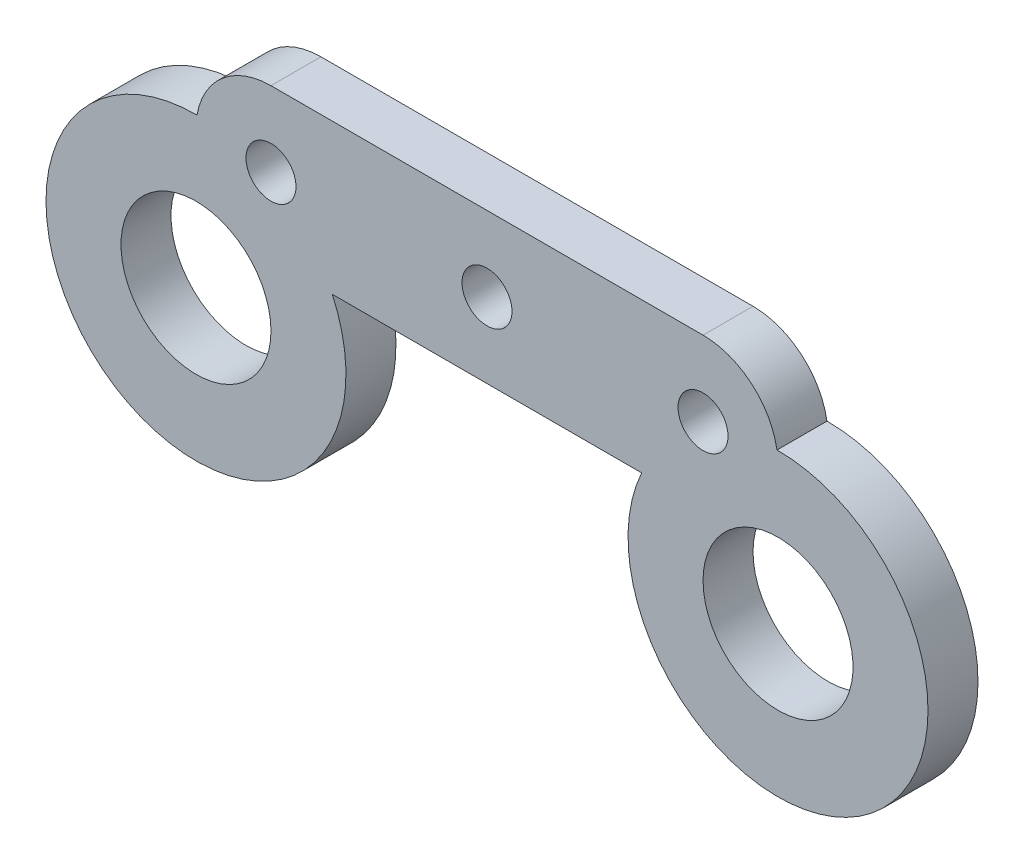
ISO-10303-21;
HEADER;
FILE_DESCRIPTION(('STEP AP214'),'2;1');
FILE_NAME('part.step','',(''),(''),'','','');
FILE_SCHEMA(('AUTOMOTIVE_DESIGN { 1 0 10303 214 1 1 1 1 }'));
ENDSEC;
DATA;
#1=APPLICATION_CONTEXT('core data for automotive mechanical design processes');
#2=APPLICATION_PROTOCOL_DEFINITION('international standard','automotive_design',2000,#1);
#3=PRODUCT_CONTEXT('',#1,'mechanical');
#4=PRODUCT('Part','Part','',(#3));
#5=PRODUCT_RELATED_PRODUCT_CATEGORY('part','',(#4));
#6=PRODUCT_DEFINITION_FORMATION('','',#4);
#7=PRODUCT_DEFINITION_CONTEXT('part definition',#1,'design');
#8=PRODUCT_DEFINITION('design','',#6,#7);
#9=PRODUCT_DEFINITION_SHAPE('','',#8);
#10=(LENGTH_UNIT() NAMED_UNIT(*) SI_UNIT(.MILLI.,.METRE.));
#11=(NAMED_UNIT(*) PLANE_ANGLE_UNIT() SI_UNIT($,.RADIAN.));
#12=(NAMED_UNIT(*) SI_UNIT($,.STERADIAN.) SOLID_ANGLE_UNIT());
#13=UNCERTAINTY_MEASURE_WITH_UNIT(LENGTH_MEASURE(1.E-05),#10,'distance_accuracy_value','');
#14=(GEOMETRIC_REPRESENTATION_CONTEXT(3) GLOBAL_UNCERTAINTY_ASSIGNED_CONTEXT((#13)) GLOBAL_UNIT_ASSIGNED_CONTEXT((#10,
#11,#12)) REPRESENTATION_CONTEXT('',''));
#15=CARTESIAN_POINT('',(0.,0.,0.));
#16=DIRECTION('',(0.,0.,1.));
#17=DIRECTION('',(1.,0.,0.));
#18=AXIS2_PLACEMENT_3D('',#15,#16,#17);
#19=CARTESIAN_POINT('',(-11.6421383013536,-5.50000000000006,2.));
#20=DIRECTION('',(0.,0.,1.));
#21=DIRECTION('',(1.,0.,0.));
#22=AXIS2_PLACEMENT_3D('',#19,#20,#21);
#23=PLANE('',#22);
#24=CARTESIAN_POINT('',(8.64213830135374,0.,2.));
#25=DIRECTION('',(0.,0.,1.));
#26=DIRECTION('',(-1.,0.,0.));
#27=AXIS2_PLACEMENT_3D('',#24,#25,#26);
#28=CIRCLE('',#27,1.00000000000005);
#29=CARTESIAN_POINT('',(7.64213830135369,0.,2.));
#30=VERTEX_POINT('',#29);
#31=EDGE_CURVE('E204',#30,#30,#28,.T.);
#32=ORIENTED_EDGE('',*,*,#31,.F.);
#33=EDGE_LOOP('',(#32));
#34=FACE_BOUND('',#33,.T.);
#35=CARTESIAN_POINT('',(-8.64213830135374,0.,2.));
#36=DIRECTION('',(0.,0.,1.));
#37=DIRECTION('',(1.,0.,0.));
#38=AXIS2_PLACEMENT_3D('',#35,#36,#37);
#39=CIRCLE('',#38,1.00000000000005);
#40=CARTESIAN_POINT('',(-7.64213830135369,0.,2.));
#41=VERTEX_POINT('',#40);
#42=EDGE_CURVE('E216',#41,#41,#39,.T.);
#43=ORIENTED_EDGE('',*,*,#42,.F.);
#44=EDGE_LOOP('',(#43));
#45=FACE_BOUND('',#44,.T.);
#46=CARTESIAN_POINT('',(-11.6421383013536,-5.50000000000006,2.));
#47=DIRECTION('',(0.,0.,1.));
#48=DIRECTION('',(1.,0.,0.));
#49=AXIS2_PLACEMENT_3D('',#46,#47,#48);
#50=CIRCLE('',#49,5.99999999999999);
#51=CARTESIAN_POINT('',(-11.6002029605603,0.499853450476246,2.));
#52=VERTEX_POINT('',#51);
#53=CARTESIAN_POINT('',(-6.18778224403582,-3.,2.));
#54=VERTEX_POINT('',#53);
#55=EDGE_CURVE('E128',#52,#54,#50,.T.);
#56=ORIENTED_EDGE('',*,*,#55,.T.);
#57=DIRECTION('',(1.,0.,0.));
#58=VECTOR('',#57,1.);
#59=CARTESIAN_POINT('',(-6.18778224403582,-3.,2.));
#60=LINE('',#59,#58);
#61=CARTESIAN_POINT('',(6.18778224403561,-3.00000000000001,2.));
#62=VERTEX_POINT('',#61);
#63=EDGE_CURVE('E86',#54,#62,#60,.T.);
#64=ORIENTED_EDGE('',*,*,#63,.T.);
#65=CARTESIAN_POINT('',(11.6421383013534,-5.50000000000006,2.));
#66=DIRECTION('',(0.,0.,1.));
#67=DIRECTION('',(1.,0.,0.));
#68=AXIS2_PLACEMENT_3D('',#65,#66,#67);
#69=CIRCLE('',#68,5.99999999999999);
#70=CARTESIAN_POINT('',(11.6002029605603,0.499853450476245,2.));
#71=VERTEX_POINT('',#70);
#72=EDGE_CURVE('E99',#62,#71,#69,.T.);
#73=ORIENTED_EDGE('',*,*,#72,.T.);
#74=CARTESIAN_POINT('',(8.64213830135374,0.,2.));
#75=DIRECTION('',(0.,0.,1.));
#76=DIRECTION('',(-1.,0.,0.));
#77=AXIS2_PLACEMENT_3D('',#74,#75,#76);
#78=CIRCLE('',#77,3.00000000000001);
#79=CARTESIAN_POINT('',(8.64213830135374,3.00000000000001,2.));
#80=VERTEX_POINT('',#79);
#81=EDGE_CURVE('E93',#71,#80,#78,.T.);
#82=ORIENTED_EDGE('',*,*,#81,.T.);
#83=DIRECTION('',(-1.,0.,0.));
#84=VECTOR('',#83,1.);
#85=CARTESIAN_POINT('',(-8.64213830135374,3.,2.));
#86=LINE('',#85,#84);
#87=CARTESIAN_POINT('',(-8.64213830135374,3.,2.));
#88=VERTEX_POINT('',#87);
#89=EDGE_CURVE('E97',#80,#88,#86,.T.);
#90=ORIENTED_EDGE('',*,*,#89,.T.);
#91=CARTESIAN_POINT('',(-8.64213830135374,0.,2.));
#92=DIRECTION('',(0.,0.,1.));
#93=DIRECTION('',(1.,0.,0.));
#94=AXIS2_PLACEMENT_3D('',#91,#92,#93);
#95=CIRCLE('',#94,3.00000000000001);
#96=EDGE_CURVE('E49',#88,#52,#95,.T.);
#97=ORIENTED_EDGE('',*,*,#96,.T.);
#98=EDGE_LOOP('',(#56,#64,#73,#82,#90,#97));
#99=FACE_BOUND('',#98,.T.);
#100=CARTESIAN_POINT('',(-11.6421383013536,-5.50000000000006,2.));
#101=DIRECTION('',(0.,0.,1.));
#102=DIRECTION('',(1.,0.,0.));
#103=AXIS2_PLACEMENT_3D('',#100,#101,#102);
#104=CIRCLE('',#103,2.99999999999999);
#105=CARTESIAN_POINT('',(-8.64213830135364,-5.50000000000006,2.));
#106=VERTEX_POINT('',#105);
#107=EDGE_CURVE('E121',#106,#106,#104,.T.);
#108=ORIENTED_EDGE('',*,*,#107,.F.);
#109=EDGE_LOOP('',(#108));
#110=FACE_BOUND('',#109,.T.);
#111=CARTESIAN_POINT('',(11.6421383013534,-5.50000000000006,2.));
#112=DIRECTION('',(0.,0.,1.));
#113=DIRECTION('',(-1.,0.,0.));
#114=AXIS2_PLACEMENT_3D('',#111,#112,#113);
#115=CIRCLE('',#114,3.0000000000013);
#116=CARTESIAN_POINT('',(8.64213830135214,-5.50000000000006,2.));
#117=VERTEX_POINT('',#116);
#118=EDGE_CURVE('E210',#117,#117,#115,.T.);
#119=ORIENTED_EDGE('',*,*,#118,.F.);
#120=EDGE_LOOP('',(#119));
#121=FACE_BOUND('',#120,.T.);
#122=CARTESIAN_POINT('',(0.,0.,2.));
#123=DIRECTION('',(0.,0.,1.));
#124=DIRECTION('',(1.,0.,0.));
#125=AXIS2_PLACEMENT_3D('',#122,#123,#124);
#126=CIRCLE('',#125,1.00000000000005);
#127=CARTESIAN_POINT('',(1.00000000000005,0.,2.));
#128=VERTEX_POINT('',#127);
#129=EDGE_CURVE('E196',#128,#128,#126,.T.);
#130=ORIENTED_EDGE('',*,*,#129,.F.);
#131=EDGE_LOOP('',(#130));
#132=FACE_BOUND('',#131,.T.);
#133=ADVANCED_FACE('F32',(#34,#45,#99,#110,#121,#132),#23,.T.);
#134=CARTESIAN_POINT('',(-11.6421383013536,-5.50000000000006,0.));
#135=DIRECTION('',(0.,0.,1.));
#136=DIRECTION('',(1.,0.,0.));
#137=AXIS2_PLACEMENT_3D('',#134,#135,#136);
#138=PLANE('',#137);
#139=CARTESIAN_POINT('',(8.64213830135374,0.,0.));
#140=DIRECTION('',(0.,0.,1.));
#141=DIRECTION('',(-1.,0.,0.));
#142=AXIS2_PLACEMENT_3D('',#139,#140,#141);
#143=CIRCLE('',#142,1.00000000000005);
#144=CARTESIAN_POINT('',(7.64213830135369,0.,0.));
#145=VERTEX_POINT('',#144);
#146=EDGE_CURVE('E202',#145,#145,#143,.T.);
#147=ORIENTED_EDGE('',*,*,#146,.T.);
#148=EDGE_LOOP('',(#147));
#149=FACE_BOUND('',#148,.T.);
#150=CARTESIAN_POINT('',(-8.64213830135374,0.,0.));
#151=DIRECTION('',(0.,0.,1.));
#152=DIRECTION('',(1.,0.,0.));
#153=AXIS2_PLACEMENT_3D('',#150,#151,#152);
#154=CIRCLE('',#153,1.00000000000005);
#155=CARTESIAN_POINT('',(-7.64213830135369,0.,0.));
#156=VERTEX_POINT('',#155);
#157=EDGE_CURVE('E213',#156,#156,#154,.T.);
#158=ORIENTED_EDGE('',*,*,#157,.T.);
#159=EDGE_LOOP('',(#158));
#160=FACE_BOUND('',#159,.T.);
#161=CARTESIAN_POINT('',(-11.6421383013536,-5.50000000000006,0.));
#162=DIRECTION('',(0.,0.,1.));
#163=DIRECTION('',(1.,0.,0.));
#164=AXIS2_PLACEMENT_3D('',#161,#162,#163);
#165=CIRCLE('',#164,5.99999999999999);
#166=CARTESIAN_POINT('',(-11.6002029605603,0.499853450476246,0.));
#167=VERTEX_POINT('',#166);
#168=CARTESIAN_POINT('',(-6.18778224403582,-3.,0.));
#169=VERTEX_POINT('',#168);
#170=EDGE_CURVE('E117',#167,#169,#165,.T.);
#171=ORIENTED_EDGE('',*,*,#170,.F.);
#172=CARTESIAN_POINT('',(-8.64213830135374,0.,0.));
#173=DIRECTION('',(0.,0.,1.));
#174=DIRECTION('',(1.,0.,0.));
#175=AXIS2_PLACEMENT_3D('',#172,#173,#174);
#176=CIRCLE('',#175,3.00000000000001);
#177=CARTESIAN_POINT('',(-8.64213830135374,3.,0.));
#178=VERTEX_POINT('',#177);
#179=EDGE_CURVE('E78',#178,#167,#176,.T.);
#180=ORIENTED_EDGE('',*,*,#179,.F.);
#181=DIRECTION('',(-1.,0.,0.));
#182=VECTOR('',#181,1.);
#183=CARTESIAN_POINT('',(-8.64213830135374,3.,0.));
#184=LINE('',#183,#182);
#185=CARTESIAN_POINT('',(8.64213830135374,3.00000000000001,0.));
#186=VERTEX_POINT('',#185);
#187=EDGE_CURVE('E72',#186,#178,#184,.T.);
#188=ORIENTED_EDGE('',*,*,#187,.F.);
#189=CARTESIAN_POINT('',(8.64213830135374,0.,0.));
#190=DIRECTION('',(0.,0.,1.));
#191=DIRECTION('',(-1.,0.,0.));
#192=AXIS2_PLACEMENT_3D('',#189,#190,#191);
#193=CIRCLE('',#192,3.00000000000001);
#194=CARTESIAN_POINT('',(11.6002029605603,0.499853450476245,0.));
#195=VERTEX_POINT('',#194);
#196=EDGE_CURVE('E107',#195,#186,#193,.T.);
#197=ORIENTED_EDGE('',*,*,#196,.F.);
#198=CARTESIAN_POINT('',(11.6421383013534,-5.50000000000006,0.));
#199=DIRECTION('',(0.,0.,1.));
#200=DIRECTION('',(1.,0.,0.));
#201=AXIS2_PLACEMENT_3D('',#198,#199,#200);
#202=CIRCLE('',#201,5.99999999999999);
#203=CARTESIAN_POINT('',(6.18778224403561,-3.00000000000001,0.));
#204=VERTEX_POINT('',#203);
#205=EDGE_CURVE('E123',#204,#195,#202,.T.);
#206=ORIENTED_EDGE('',*,*,#205,.F.);
#207=DIRECTION('',(1.,0.,0.));
#208=VECTOR('',#207,1.);
#209=CARTESIAN_POINT('',(-6.18778224403582,-3.,0.));
#210=LINE('',#209,#208);
#211=EDGE_CURVE('E120',#169,#204,#210,.T.);
#212=ORIENTED_EDGE('',*,*,#211,.F.);
#213=EDGE_LOOP('',(#171,#180,#188,#197,#206,#212));
#214=FACE_BOUND('',#213,.T.);
#215=CARTESIAN_POINT('',(-11.6421383013536,-5.50000000000006,0.));
#216=DIRECTION('',(0.,0.,1.));
#217=DIRECTION('',(1.,0.,0.));
#218=AXIS2_PLACEMENT_3D('',#215,#216,#217);
#219=CIRCLE('',#218,2.99999999999999);
#220=CARTESIAN_POINT('',(-8.64213830135364,-5.50000000000006,0.));
#221=VERTEX_POINT('',#220);
#222=EDGE_CURVE('E219',#221,#221,#219,.T.);
#223=ORIENTED_EDGE('',*,*,#222,.T.);
#224=EDGE_LOOP('',(#223));
#225=FACE_BOUND('',#224,.T.);
#226=CARTESIAN_POINT('',(11.6421383013534,-5.50000000000006,0.));
#227=DIRECTION('',(0.,0.,1.));
#228=DIRECTION('',(-1.,0.,0.));
#229=AXIS2_PLACEMENT_3D('',#226,#227,#228);
#230=CIRCLE('',#229,3.0000000000013);
#231=CARTESIAN_POINT('',(8.64213830135214,-5.50000000000006,0.));
#232=VERTEX_POINT('',#231);
#233=EDGE_CURVE('E207',#232,#232,#230,.T.);
#234=ORIENTED_EDGE('',*,*,#233,.T.);
#235=EDGE_LOOP('',(#234));
#236=FACE_BOUND('',#235,.T.);
#237=CARTESIAN_POINT('',(0.,0.,0.));
#238=DIRECTION('',(0.,0.,1.));
#239=DIRECTION('',(1.,0.,0.));
#240=AXIS2_PLACEMENT_3D('',#237,#238,#239);
#241=CIRCLE('',#240,1.00000000000005);
#242=CARTESIAN_POINT('',(1.00000000000005,0.,0.));
#243=VERTEX_POINT('',#242);
#244=EDGE_CURVE('E192',#243,#243,#241,.T.);
#245=ORIENTED_EDGE('',*,*,#244,.T.);
#246=EDGE_LOOP('',(#245));
#247=FACE_BOUND('',#246,.T.);
#248=ADVANCED_FACE('F137',(#149,#160,#214,#225,#236,#247),#138,.F.);
#249=CARTESIAN_POINT('',(-11.6421383013536,-5.50000000000006,2.));
#250=DIRECTION('',(0.,0.,-1.));
#251=DIRECTION('',(-1.,0.,0.));
#252=AXIS2_PLACEMENT_3D('',#249,#250,#251);
#253=CYLINDRICAL_SURFACE('',#252,5.99999999999999);
#254=ORIENTED_EDGE('',*,*,#170,.T.);
#255=DIRECTION('',(0.,0.,-1.));
#256=VECTOR('',#255,1.);
#257=CARTESIAN_POINT('',(-6.18778224403582,-3.,2.));
#258=LINE('',#257,#256);
#259=EDGE_CURVE('E11',#54,#169,#258,.T.);
#260=ORIENTED_EDGE('',*,*,#259,.F.);
#261=ORIENTED_EDGE('',*,*,#55,.F.);
#262=DIRECTION('',(0.,0.,-1.));
#263=VECTOR('',#262,1.);
#264=CARTESIAN_POINT('',(-11.6002029605603,0.499853450476246,2.));
#265=LINE('',#264,#263);
#266=EDGE_CURVE('E113',#52,#167,#265,.T.);
#267=ORIENTED_EDGE('',*,*,#266,.T.);
#268=EDGE_LOOP('',(#254,#260,#261,#267));
#269=FACE_BOUND('',#268,.T.);
#270=ADVANCED_FACE('F34',(#269),#253,.T.);
#271=CARTESIAN_POINT('',(-6.18778224403582,-3.,2.));
#272=DIRECTION('',(0.,1.,0.));
#273=DIRECTION('',(-1.,0.,0.));
#274=AXIS2_PLACEMENT_3D('',#271,#272,#273);
#275=PLANE('',#274);
#276=CARTESIAN_POINT('',(0.,-3.00000000000001,1.));
#277=DIRECTION('',(0.,-1.,0.));
#278=DIRECTION('',(0.,0.,-1.));
#279=AXIS2_PLACEMENT_3D('',#276,#277,#278);
#280=CIRCLE('',#279,0.5);
#281=CARTESIAN_POINT('',(0.,-3.00000000000001,0.5));
#282=VERTEX_POINT('',#281);
#283=EDGE_CURVE('E193',#282,#282,#280,.T.);
#284=ORIENTED_EDGE('',*,*,#283,.F.);
#285=EDGE_LOOP('',(#284));
#286=FACE_BOUND('',#285,.T.);
#287=ORIENTED_EDGE('',*,*,#211,.T.);
#288=DIRECTION('',(0.,0.,-1.));
#289=VECTOR('',#288,1.);
#290=CARTESIAN_POINT('',(6.18778224403561,-3.00000000000001,2.));
#291=LINE('',#290,#289);
#292=EDGE_CURVE('E41',#62,#204,#291,.T.);
#293=ORIENTED_EDGE('',*,*,#292,.F.);
#294=ORIENTED_EDGE('',*,*,#63,.F.);
#295=ORIENTED_EDGE('',*,*,#259,.T.);
#296=EDGE_LOOP('',(#287,#293,#294,#295));
#297=FACE_BOUND('',#296,.T.);
#298=ADVANCED_FACE('F249',(#286,#297),#275,.F.);
#299=CARTESIAN_POINT('',(11.6421383013534,-5.50000000000006,2.));
#300=DIRECTION('',(0.,0.,-1.));
#301=DIRECTION('',(-1.,0.,0.));
#302=AXIS2_PLACEMENT_3D('',#299,#300,#301);
#303=CYLINDRICAL_SURFACE('',#302,5.99999999999999);
#304=ORIENTED_EDGE('',*,*,#205,.T.);
#305=DIRECTION('',(0.,0.,-1.));
#306=VECTOR('',#305,1.);
#307=CARTESIAN_POINT('',(11.6002029605603,0.499853450476245,2.));
#308=LINE('',#307,#306);
#309=EDGE_CURVE('E108',#71,#195,#308,.T.);
#310=ORIENTED_EDGE('',*,*,#309,.F.);
#311=ORIENTED_EDGE('',*,*,#72,.F.);
#312=ORIENTED_EDGE('',*,*,#292,.T.);
#313=EDGE_LOOP('',(#304,#310,#311,#312));
#314=FACE_BOUND('',#313,.T.);
#315=ADVANCED_FACE('F134',(#314),#303,.T.);
#316=CARTESIAN_POINT('',(8.64213830135374,0.,2.));
#317=DIRECTION('',(0.,0.,-1.));
#318=DIRECTION('',(-1.,0.,0.));
#319=AXIS2_PLACEMENT_3D('',#316,#317,#318);
#320=CYLINDRICAL_SURFACE('',#319,3.00000000000001);
#321=ORIENTED_EDGE('',*,*,#196,.T.);
#322=DIRECTION('',(0.,0.,-1.));
#323=VECTOR('',#322,1.);
#324=CARTESIAN_POINT('',(8.64213830135374,3.00000000000001,2.));
#325=LINE('',#324,#323);
#326=EDGE_CURVE('E104',#80,#186,#325,.T.);
#327=ORIENTED_EDGE('',*,*,#326,.F.);
#328=ORIENTED_EDGE('',*,*,#81,.F.);
#329=ORIENTED_EDGE('',*,*,#309,.T.);
#330=EDGE_LOOP('',(#321,#327,#328,#329));
#331=FACE_BOUND('',#330,.T.);
#332=ADVANCED_FACE('F105',(#331),#320,.T.);
#333=CARTESIAN_POINT('',(-8.64213830135374,3.,2.));
#334=DIRECTION('',(0.,-1.,0.));
#335=DIRECTION('',(0.,0.,-1.));
#336=AXIS2_PLACEMENT_3D('',#333,#334,#335);
#337=PLANE('',#336);
#338=ORIENTED_EDGE('',*,*,#187,.T.);
#339=DIRECTION('',(0.,0.,-1.));
#340=VECTOR('',#339,1.);
#341=CARTESIAN_POINT('',(-8.64213830135374,3.,2.));
#342=LINE('',#341,#340);
#343=EDGE_CURVE('E109',#88,#178,#342,.T.);
#344=ORIENTED_EDGE('',*,*,#343,.F.);
#345=ORIENTED_EDGE('',*,*,#89,.F.);
#346=ORIENTED_EDGE('',*,*,#326,.T.);
#347=EDGE_LOOP('',(#338,#344,#345,#346));
#348=FACE_BOUND('',#347,.T.);
#349=ADVANCED_FACE('F111',(#348),#337,.F.);
#350=CARTESIAN_POINT('',(-8.64213830135374,0.,2.));
#351=DIRECTION('',(0.,0.,-1.));
#352=DIRECTION('',(-1.,0.,0.));
#353=AXIS2_PLACEMENT_3D('',#350,#351,#352);
#354=CYLINDRICAL_SURFACE('',#353,3.00000000000001);
#355=ORIENTED_EDGE('',*,*,#179,.T.);
#356=ORIENTED_EDGE('',*,*,#266,.F.);
#357=ORIENTED_EDGE('',*,*,#96,.F.);
#358=ORIENTED_EDGE('',*,*,#343,.T.);
#359=EDGE_LOOP('',(#355,#356,#357,#358));
#360=FACE_BOUND('',#359,.T.);
#361=ADVANCED_FACE('F142',(#360),#354,.T.);
#362=CARTESIAN_POINT('',(-11.6421383013536,-5.50000000000006,2.));
#363=DIRECTION('',(0.,0.,-1.));
#364=DIRECTION('',(-1.,0.,0.));
#365=AXIS2_PLACEMENT_3D('',#362,#363,#364);
#366=CYLINDRICAL_SURFACE('',#365,2.99999999999999);
#367=ORIENTED_EDGE('',*,*,#107,.T.);
#368=EDGE_LOOP('',(#367));
#369=FACE_BOUND('',#368,.T.);
#370=ORIENTED_EDGE('',*,*,#222,.F.);
#371=EDGE_LOOP('',(#370));
#372=FACE_BOUND('',#371,.T.);
#373=ADVANCED_FACE('F144',(#369,#372),#366,.F.);
#374=CARTESIAN_POINT('',(-8.64213830135374,0.,2.));
#375=DIRECTION('',(0.,0.,-1.));
#376=DIRECTION('',(-1.,0.,0.));
#377=AXIS2_PLACEMENT_3D('',#374,#375,#376);
#378=CYLINDRICAL_SURFACE('',#377,1.00000000000005);
#379=ORIENTED_EDGE('',*,*,#42,.T.);
#380=EDGE_LOOP('',(#379));
#381=FACE_BOUND('',#380,.T.);
#382=ORIENTED_EDGE('',*,*,#157,.F.);
#383=EDGE_LOOP('',(#382));
#384=FACE_BOUND('',#383,.T.);
#385=ADVANCED_FACE('F150',(#381,#384),#378,.F.);
#386=CARTESIAN_POINT('',(11.6421383013534,-5.50000000000006,2.));
#387=DIRECTION('',(0.,0.,-1.));
#388=DIRECTION('',(-1.,0.,0.));
#389=AXIS2_PLACEMENT_3D('',#386,#387,#388);
#390=CYLINDRICAL_SURFACE('',#389,3.0000000000013);
#391=ORIENTED_EDGE('',*,*,#118,.T.);
#392=EDGE_LOOP('',(#391));
#393=FACE_BOUND('',#392,.T.);
#394=ORIENTED_EDGE('',*,*,#233,.F.);
#395=EDGE_LOOP('',(#394));
#396=FACE_BOUND('',#395,.T.);
#397=ADVANCED_FACE('F167',(#393,#396),#390,.F.);
#398=CARTESIAN_POINT('',(8.64213830135374,0.,2.));
#399=DIRECTION('',(0.,0.,-1.));
#400=DIRECTION('',(-1.,0.,0.));
#401=AXIS2_PLACEMENT_3D('',#398,#399,#400);
#402=CYLINDRICAL_SURFACE('',#401,1.00000000000005);
#403=ORIENTED_EDGE('',*,*,#31,.T.);
#404=EDGE_LOOP('',(#403));
#405=FACE_BOUND('',#404,.T.);
#406=ORIENTED_EDGE('',*,*,#146,.F.);
#407=EDGE_LOOP('',(#406));
#408=FACE_BOUND('',#407,.T.);
#409=ADVANCED_FACE('F171',(#405,#408),#402,.F.);
#410=CARTESIAN_POINT('',(0.,0.,2.));
#411=DIRECTION('',(0.,0.,-1.));
#412=DIRECTION('',(-1.,0.,0.));
#413=AXIS2_PLACEMENT_3D('',#410,#411,#412);
#414=CYLINDRICAL_SURFACE('',#413,1.00000000000005);
#415=ORIENTED_EDGE('',*,*,#129,.T.);
#416=EDGE_LOOP('',(#415));
#417=FACE_BOUND('',#416,.T.);
#418=ORIENTED_EDGE('',*,*,#244,.F.);
#419=EDGE_LOOP('',(#418));
#420=FACE_BOUND('',#419,.T.);
#421=ADVANCED_FACE('F175',(#417,#420),#414,.F.);
#422=CARTESIAN_POINT('',(0.,-2.50000000000001,1.));
#423=DIRECTION('',(0.,-1.,0.));
#424=DIRECTION('',(0.,0.,-1.));
#425=AXIS2_PLACEMENT_3D('',#422,#423,#424);
#426=CYLINDRICAL_SURFACE('',#425,0.5);
#427=CARTESIAN_POINT('',(0.,-2.50000000000001,1.));
#428=DIRECTION('',(0.,-1.,0.));
#429=DIRECTION('',(0.,0.,-1.));
#430=AXIS2_PLACEMENT_3D('',#427,#428,#429);
#431=CIRCLE('',#430,0.5);
#432=CARTESIAN_POINT('',(0.,-2.50000000000001,0.5));
#433=VERTEX_POINT('',#432);
#434=EDGE_CURVE('E191',#433,#433,#431,.T.);
#435=ORIENTED_EDGE('',*,*,#434,.F.);
#436=EDGE_LOOP('',(#435));
#437=FACE_BOUND('',#436,.T.);
#438=ORIENTED_EDGE('',*,*,#283,.T.);
#439=EDGE_LOOP('',(#438));
#440=FACE_BOUND('',#439,.T.);
#441=ADVANCED_FACE('F179',(#437,#440),#426,.F.);
#442=CARTESIAN_POINT('',(0.,-2.50000000000001,1.));
#443=DIRECTION('',(0.,-1.,0.));
#444=DIRECTION('',(0.,0.,-1.));
#445=AXIS2_PLACEMENT_3D('',#442,#443,#444);
#446=PLANE('',#445);
#447=ORIENTED_EDGE('',*,*,#434,.T.);
#448=EDGE_LOOP('',(#447));
#449=FACE_BOUND('',#448,.T.);
#450=ADVANCED_FACE('F183',(#449),#446,.T.);
#451=CLOSED_SHELL('',(#133,#248,#270,#298,#315,#332,#349,#361,#373,#385,#397,#409,#421,#441,#450));
#452=MANIFOLD_SOLID_BREP('B2',#451);
#453=ADVANCED_BREP_SHAPE_REPRESENTATION('',(#18,#452),#14);
#454=SHAPE_DEFINITION_REPRESENTATION(#9,#453);
ENDSEC;
END-ISO-10303-21;
